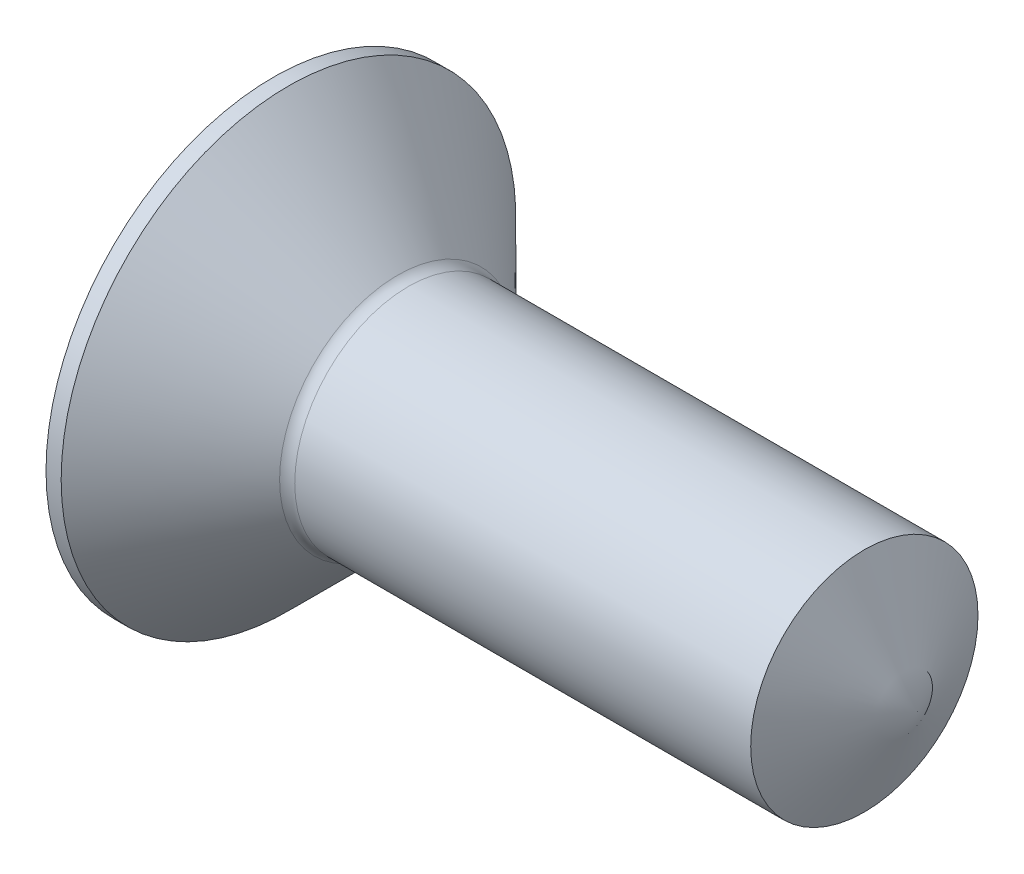
ISO-10303-21;
HEADER;
FILE_DESCRIPTION(('STEP AP214'),'2;1');
FILE_NAME('part.step','',(''),(''),'','','');
FILE_SCHEMA(('AUTOMOTIVE_DESIGN { 1 0 10303 214 1 1 1 1 }'));
ENDSEC;
DATA;
#1=APPLICATION_CONTEXT('core data for automotive mechanical design processes');
#2=APPLICATION_PROTOCOL_DEFINITION('international standard','automotive_design',2000,#1);
#3=PRODUCT_CONTEXT('',#1,'mechanical');
#4=PRODUCT('Part','Part','',(#3));
#5=PRODUCT_RELATED_PRODUCT_CATEGORY('part','',(#4));
#6=PRODUCT_DEFINITION_FORMATION('','',#4);
#7=PRODUCT_DEFINITION_CONTEXT('part definition',#1,'design');
#8=PRODUCT_DEFINITION('design','',#6,#7);
#9=PRODUCT_DEFINITION_SHAPE('','',#8);
#10=(LENGTH_UNIT() NAMED_UNIT(*) SI_UNIT(.MILLI.,.METRE.));
#11=(NAMED_UNIT(*) PLANE_ANGLE_UNIT() SI_UNIT($,.RADIAN.));
#12=(NAMED_UNIT(*) SI_UNIT($,.STERADIAN.) SOLID_ANGLE_UNIT());
#13=UNCERTAINTY_MEASURE_WITH_UNIT(LENGTH_MEASURE(1.E-05),#10,'distance_accuracy_value','');
#14=(GEOMETRIC_REPRESENTATION_CONTEXT(3) GLOBAL_UNCERTAINTY_ASSIGNED_CONTEXT((#13)) GLOBAL_UNIT_ASSIGNED_CONTEXT((#10,
#11,#12)) REPRESENTATION_CONTEXT('',''));
#15=CARTESIAN_POINT('',(0.,0.,0.));
#16=DIRECTION('',(0.,0.,1.));
#17=DIRECTION('',(1.,0.,0.));
#18=AXIS2_PLACEMENT_3D('',#15,#16,#17);
#19=CARTESIAN_POINT('',(-6.50645201269086,0.,0.));
#20=DIRECTION('',(-1.,0.,0.));
#21=DIRECTION('',(0.,0.,1.));
#22=AXIS2_PLACEMENT_3D('',#19,#20,#21);
#23=CYLINDRICAL_SURFACE('',#22,1.5);
#24=CARTESIAN_POINT('',(1.78284271247462,0.,0.));
#25=DIRECTION('',(-1.,0.,0.));
#26=DIRECTION('',(0.,0.,1.));
#27=AXIS2_PLACEMENT_3D('',#24,#25,#26);
#28=CIRCLE('',#27,1.5);
#29=CARTESIAN_POINT('',(1.78284271247462,0.,1.5));
#30=VERTEX_POINT('',#29);
#31=EDGE_CURVE('E12',#30,#30,#28,.F.);
#32=ORIENTED_EDGE('',*,*,#31,.T.);
#33=EDGE_LOOP('',(#32));
#34=FACE_BOUND('',#33,.T.);
#35=CARTESIAN_POINT('',(7.80053851276751,0.,0.));
#36=DIRECTION('',(-1.,0.,0.));
#37=DIRECTION('',(0.,0.,1.));
#38=AXIS2_PLACEMENT_3D('',#35,#36,#37);
#39=CIRCLE('',#38,1.5);
#40=CARTESIAN_POINT('',(7.80053851276751,0.,1.5));
#41=VERTEX_POINT('',#40);
#42=EDGE_CURVE('E130',#41,#41,#39,.F.);
#43=ORIENTED_EDGE('',*,*,#42,.F.);
#44=EDGE_LOOP('',(#43));
#45=FACE_BOUND('',#44,.T.);
#46=ADVANCED_FACE('F51',(#34,#45),#23,.T.);
#47=CARTESIAN_POINT('',(1.7,0.,0.));
#48=DIRECTION('',(-1.,0.,0.));
#49=DIRECTION('',(0.,0.,1.));
#50=AXIS2_PLACEMENT_3D('',#47,#48,#49);
#51=CONICAL_SURFACE('',#50,1.5,0.785398163397443);
#52=CARTESIAN_POINT('',(1.64142135623731,0.,0.));
#53=DIRECTION('',(-1.,0.,0.));
#54=DIRECTION('',(0.,0.,1.));
#55=AXIS2_PLACEMENT_3D('',#52,#53,#54);
#56=CIRCLE('',#55,1.55857864376269);
#57=CARTESIAN_POINT('',(1.64142135623731,0.,1.55857864376269));
#58=VERTEX_POINT('',#57);
#59=EDGE_CURVE('E60',#58,#58,#56,.T.);
#60=ORIENTED_EDGE('',*,*,#59,.T.);
#61=EDGE_LOOP('',(#60));
#62=FACE_BOUND('',#61,.T.);
#63=CARTESIAN_POINT('',(0.199999999999983,0.,0.));
#64=DIRECTION('',(-1.,0.,0.));
#65=DIRECTION('',(0.,0.,1.));
#66=AXIS2_PLACEMENT_3D('',#63,#64,#65);
#67=CIRCLE('',#66,3.);
#68=CARTESIAN_POINT('',(0.199999999999983,0.,3.));
#69=VERTEX_POINT('',#68);
#70=EDGE_CURVE('E467',#69,#69,#67,.T.);
#71=ORIENTED_EDGE('',*,*,#70,.F.);
#72=EDGE_LOOP('',(#71));
#73=FACE_BOUND('',#72,.T.);
#74=ADVANCED_FACE('F283',(#62,#73),#51,.T.);
#75=CARTESIAN_POINT('',(-6.50645201269086,0.,0.));
#76=DIRECTION('',(-1.,0.,0.));
#77=DIRECTION('',(0.,0.,1.));
#78=AXIS2_PLACEMENT_3D('',#75,#76,#77);
#79=CYLINDRICAL_SURFACE('',#78,3.);
#80=CARTESIAN_POINT('',(0.,0.,0.));
#81=DIRECTION('',(-1.,0.,0.));
#82=DIRECTION('',(0.,0.,1.));
#83=AXIS2_PLACEMENT_3D('',#80,#81,#82);
#84=CIRCLE('',#83,3.);
#85=CARTESIAN_POINT('',(0.,0.,3.));
#86=VERTEX_POINT('',#85);
#87=EDGE_CURVE('E133',#86,#86,#84,.T.);
#88=ORIENTED_EDGE('',*,*,#87,.F.);
#89=EDGE_LOOP('',(#88));
#90=FACE_BOUND('',#89,.T.);
#91=ORIENTED_EDGE('',*,*,#70,.T.);
#92=EDGE_LOOP('',(#91));
#93=FACE_BOUND('',#92,.T.);
#94=ADVANCED_FACE('F288',(#90,#93),#79,.T.);
#95=CARTESIAN_POINT('',(0.,0.,-3.));
#96=DIRECTION('',(1.,0.,0.));
#97=DIRECTION('',(0.,0.,-1.));
#98=AXIS2_PLACEMENT_3D('',#95,#96,#97);
#99=PLANE('',#98);
#100=DIRECTION('',(0.,0.,-1.));
#101=VECTOR('',#100,1.);
#102=CARTESIAN_POINT('',(0.,0.38,-0.38));
#103=LINE('',#102,#101);
#104=CARTESIAN_POINT('',(0.,0.38,-0.38));
#105=VERTEX_POINT('',#104);
#106=CARTESIAN_POINT('',(0.,0.38,-1.9));
#107=VERTEX_POINT('',#106);
#108=EDGE_CURVE('E112',#105,#107,#103,.T.);
#109=ORIENTED_EDGE('',*,*,#108,.F.);
#110=DIRECTION('',(0.,-1.,0.));
#111=VECTOR('',#110,1.);
#112=CARTESIAN_POINT('',(0.,0.38,-0.38));
#113=LINE('',#112,#111);
#114=CARTESIAN_POINT('',(0.,1.9,-0.38));
#115=VERTEX_POINT('',#114);
#116=EDGE_CURVE('E117',#115,#105,#113,.T.);
#117=ORIENTED_EDGE('',*,*,#116,.F.);
#118=DIRECTION('',(0.,0.,-1.));
#119=VECTOR('',#118,1.);
#120=CARTESIAN_POINT('',(0.,1.9,0.38));
#121=LINE('',#120,#119);
#122=CARTESIAN_POINT('',(0.,1.9,0.38));
#123=VERTEX_POINT('',#122);
#124=EDGE_CURVE('E124',#123,#115,#121,.T.);
#125=ORIENTED_EDGE('',*,*,#124,.F.);
#126=DIRECTION('',(0.,1.,0.));
#127=VECTOR('',#126,1.);
#128=CARTESIAN_POINT('',(0.,0.38,0.38));
#129=LINE('',#128,#127);
#130=CARTESIAN_POINT('',(0.,0.38,0.38));
#131=VERTEX_POINT('',#130);
#132=EDGE_CURVE('E174',#131,#123,#129,.T.);
#133=ORIENTED_EDGE('',*,*,#132,.F.);
#134=DIRECTION('',(0.,0.,-1.));
#135=VECTOR('',#134,1.);
#136=CARTESIAN_POINT('',(0.,0.380000000000001,1.9));
#137=LINE('',#136,#135);
#138=CARTESIAN_POINT('',(0.,0.380000000000001,1.9));
#139=VERTEX_POINT('',#138);
#140=EDGE_CURVE('E172',#139,#131,#137,.T.);
#141=ORIENTED_EDGE('',*,*,#140,.F.);
#142=DIRECTION('',(0.,1.,0.));
#143=VECTOR('',#142,1.);
#144=CARTESIAN_POINT('',(0.,0.380000000000001,1.9));
#145=LINE('',#144,#143);
#146=CARTESIAN_POINT('',(0.,-0.380000000000001,1.9));
#147=VERTEX_POINT('',#146);
#148=EDGE_CURVE('E168',#147,#139,#145,.T.);
#149=ORIENTED_EDGE('',*,*,#148,.F.);
#150=DIRECTION('',(0.,0.,1.));
#151=VECTOR('',#150,1.);
#152=CARTESIAN_POINT('',(0.,-0.380000000000001,1.9));
#153=LINE('',#152,#151);
#154=CARTESIAN_POINT('',(0.,-0.38,0.38));
#155=VERTEX_POINT('',#154);
#156=EDGE_CURVE('E164',#155,#147,#153,.T.);
#157=ORIENTED_EDGE('',*,*,#156,.F.);
#158=DIRECTION('',(0.,1.,0.));
#159=VECTOR('',#158,1.);
#160=CARTESIAN_POINT('',(0.,-1.9,0.380000000000001));
#161=LINE('',#160,#159);
#162=CARTESIAN_POINT('',(0.,-1.9,0.380000000000001));
#163=VERTEX_POINT('',#162);
#164=EDGE_CURVE('E160',#163,#155,#161,.T.);
#165=ORIENTED_EDGE('',*,*,#164,.F.);
#166=DIRECTION('',(0.,0.,1.));
#167=VECTOR('',#166,1.);
#168=CARTESIAN_POINT('',(0.,-1.9,0.380000000000001));
#169=LINE('',#168,#167);
#170=CARTESIAN_POINT('',(0.,-1.9,-0.38));
#171=VERTEX_POINT('',#170);
#172=EDGE_CURVE('E156',#171,#163,#169,.T.);
#173=ORIENTED_EDGE('',*,*,#172,.F.);
#174=DIRECTION('',(0.,-1.,0.));
#175=VECTOR('',#174,1.);
#176=CARTESIAN_POINT('',(0.,-1.9,-0.38));
#177=LINE('',#176,#175);
#178=CARTESIAN_POINT('',(0.,-0.38,-0.38));
#179=VERTEX_POINT('',#178);
#180=EDGE_CURVE('E159',#179,#171,#177,.T.);
#181=ORIENTED_EDGE('',*,*,#180,.F.);
#182=DIRECTION('',(0.,0.,1.));
#183=VECTOR('',#182,1.);
#184=CARTESIAN_POINT('',(0.,-0.38,-0.38));
#185=LINE('',#184,#183);
#186=CARTESIAN_POINT('',(0.,-0.38,-1.9));
#187=VERTEX_POINT('',#186);
#188=EDGE_CURVE('E135',#187,#179,#185,.T.);
#189=ORIENTED_EDGE('',*,*,#188,.F.);
#190=DIRECTION('',(0.,-1.,0.));
#191=VECTOR('',#190,1.);
#192=CARTESIAN_POINT('',(0.,0.38,-1.9));
#193=LINE('',#192,#191);
#194=EDGE_CURVE('E128',#107,#187,#193,.T.);
#195=ORIENTED_EDGE('',*,*,#194,.F.);
#196=EDGE_LOOP('',(#109,#117,#125,#133,#141,#149,#157,#165,#173,#181,#189,#195));
#197=FACE_BOUND('',#196,.T.);
#198=ORIENTED_EDGE('',*,*,#87,.T.);
#199=EDGE_LOOP('',(#198));
#200=FACE_BOUND('',#199,.T.);
#201=ADVANCED_FACE('F125',(#197,#200),#99,.F.);
#202=CARTESIAN_POINT('',(-0.826153163099912,0.,0.));
#203=DIRECTION('',(-1.,0.,0.));
#204=DIRECTION('',(0.,0.,1.));
#205=AXIS2_PLACEMENT_3D('',#202,#203,#204);
#206=CONICAL_SURFACE('',#205,20.,1.13446401379632);
#207=CARTESIAN_POINT('',(8.5,0.,0.));
#208=VERTEX_POINT('',#207);
#209=VERTEX_LOOP('',#208);
#210=FACE_BOUND('',#209,.T.);
#211=ORIENTED_EDGE('',*,*,#42,.T.);
#212=EDGE_LOOP('',(#211));
#213=FACE_BOUND('',#212,.T.);
#214=ADVANCED_FACE('F278',(#210,#213),#206,.T.);
#215=CARTESIAN_POINT('',(1.78284271247462,0.,0.));
#216=DIRECTION('',(-1.,0.,0.));
#217=DIRECTION('',(0.,0.,1.));
#218=AXIS2_PLACEMENT_3D('',#215,#216,#217);
#219=TOROIDAL_SURFACE('',#218,1.7,0.2);
#220=ORIENTED_EDGE('',*,*,#31,.F.);
#221=EDGE_LOOP('',(#220));
#222=FACE_BOUND('',#221,.T.);
#223=ORIENTED_EDGE('',*,*,#59,.F.);
#224=EDGE_LOOP('',(#223));
#225=FACE_BOUND('',#224,.T.);
#226=ADVANCED_FACE('F53',(#222,#225),#219,.F.);
#227=CARTESIAN_POINT('',(0.,1.9,-0.38));
#228=DIRECTION('',(0.191273821610312,0.,-0.981536716158181));
#229=DIRECTION('',(-0.981536716158182,0.,-0.191273821610312));
#230=AXIS2_PLACEMENT_3D('',#227,#228,#229);
#231=PLANE('',#230);
#232=DIRECTION('',(0.709353594431999,-0.691165040728615,0.138233008145723));
#233=VECTOR('',#232,1.);
#234=CARTESIAN_POINT('',(0.,1.9,-0.38));
#235=LINE('',#234,#233);
#236=CARTESIAN_POINT('',(1.95,0.,0.));
#237=VERTEX_POINT('',#236);
#238=EDGE_CURVE('E118',#115,#237,#235,.T.);
#239=ORIENTED_EDGE('',*,*,#238,.F.);
#240=ORIENTED_EDGE('',*,*,#116,.T.);
#241=DIRECTION('',(0.964059743790518,-0.187868052636101,0.187868052636101));
#242=VECTOR('',#241,1.);
#243=CARTESIAN_POINT('',(0.,0.38,-0.38));
#244=LINE('',#243,#242);
#245=EDGE_CURVE('E108',#105,#237,#244,.T.);
#246=ORIENTED_EDGE('',*,*,#245,.T.);
#247=EDGE_LOOP('',(#239,#240,#246));
#248=FACE_BOUND('',#247,.T.);
#249=ADVANCED_FACE('F121',(#248),#231,.F.);
#250=CARTESIAN_POINT('',(0.,0.38,-0.38));
#251=DIRECTION('',(0.191273821610312,0.981536716158181,0.));
#252=DIRECTION('',(-0.981536716158182,0.191273821610312,0.));
#253=AXIS2_PLACEMENT_3D('',#250,#251,#252);
#254=PLANE('',#253);
#255=ORIENTED_EDGE('',*,*,#245,.F.);
#256=ORIENTED_EDGE('',*,*,#108,.T.);
#257=DIRECTION('',(0.709353594431999,-0.138233008145723,0.691165040728615));
#258=VECTOR('',#257,1.);
#259=CARTESIAN_POINT('',(0.,0.38,-1.9));
#260=LINE('',#259,#258);
#261=EDGE_CURVE('E68',#107,#237,#260,.T.);
#262=ORIENTED_EDGE('',*,*,#261,.T.);
#263=EDGE_LOOP('',(#255,#256,#262));
#264=FACE_BOUND('',#263,.T.);
#265=ADVANCED_FACE('F110',(#264),#254,.F.);
#266=CARTESIAN_POINT('',(0.,1.9,0.38));
#267=DIRECTION('',(0.697864726910429,0.716229588144914,0.));
#268=DIRECTION('',(-0.716229588144914,0.697864726910429,0.));
#269=AXIS2_PLACEMENT_3D('',#266,#267,#268);
#270=PLANE('',#269);
#271=DIRECTION('',(0.709353594431999,-0.691165040728615,-0.138233008145723));
#272=VECTOR('',#271,1.);
#273=CARTESIAN_POINT('',(0.,1.9,0.38));
#274=LINE('',#273,#272);
#275=EDGE_CURVE('E184',#123,#237,#274,.T.);
#276=ORIENTED_EDGE('',*,*,#275,.F.);
#277=ORIENTED_EDGE('',*,*,#124,.T.);
#278=ORIENTED_EDGE('',*,*,#238,.T.);
#279=EDGE_LOOP('',(#276,#277,#278));
#280=FACE_BOUND('',#279,.T.);
#281=ADVANCED_FACE('F183',(#280),#270,.F.);
#282=CARTESIAN_POINT('',(0.,0.38,0.38));
#283=DIRECTION('',(0.191273821610312,0.,0.981536716158181));
#284=DIRECTION('',(0.981536716158181,0.,-0.191273821610312));
#285=AXIS2_PLACEMENT_3D('',#282,#283,#284);
#286=PLANE('',#285);
#287=DIRECTION('',(0.964059743790518,-0.187868052636101,-0.187868052636101));
#288=VECTOR('',#287,1.);
#289=CARTESIAN_POINT('',(0.,0.38,0.38));
#290=LINE('',#289,#288);
#291=EDGE_CURVE('E335',#131,#237,#290,.T.);
#292=ORIENTED_EDGE('',*,*,#291,.F.);
#293=ORIENTED_EDGE('',*,*,#132,.T.);
#294=ORIENTED_EDGE('',*,*,#275,.T.);
#295=EDGE_LOOP('',(#292,#293,#294));
#296=FACE_BOUND('',#295,.T.);
#297=ADVANCED_FACE('F204',(#296),#286,.F.);
#298=CARTESIAN_POINT('',(0.,0.380000000000001,1.9));
#299=DIRECTION('',(0.191273821610312,0.981536716158181,0.));
#300=DIRECTION('',(-0.981536716158182,0.191273821610312,0.));
#301=AXIS2_PLACEMENT_3D('',#298,#299,#300);
#302=PLANE('',#301);
#303=DIRECTION('',(0.709353594431999,-0.138233008145723,-0.691165040728615));
#304=VECTOR('',#303,1.);
#305=CARTESIAN_POINT('',(0.,0.380000000000001,1.9));
#306=LINE('',#305,#304);
#307=EDGE_CURVE('E233',#139,#237,#306,.T.);
#308=ORIENTED_EDGE('',*,*,#307,.F.);
#309=ORIENTED_EDGE('',*,*,#140,.T.);
#310=ORIENTED_EDGE('',*,*,#291,.T.);
#311=EDGE_LOOP('',(#308,#309,#310));
#312=FACE_BOUND('',#311,.T.);
#313=ADVANCED_FACE('F208',(#312),#302,.F.);
#314=CARTESIAN_POINT('',(0.,-0.380000000000001,1.9));
#315=DIRECTION('',(0.697864726910429,0.,0.716229588144914));
#316=DIRECTION('',(0.716229588144914,0.,-0.697864726910429));
#317=AXIS2_PLACEMENT_3D('',#314,#315,#316);
#318=PLANE('',#317);
#319=DIRECTION('',(0.709353594431999,0.138233008145723,-0.691165040728615));
#320=VECTOR('',#319,1.);
#321=CARTESIAN_POINT('',(0.,-0.380000000000001,1.9));
#322=LINE('',#321,#320);
#323=EDGE_CURVE('E225',#147,#237,#322,.T.);
#324=ORIENTED_EDGE('',*,*,#323,.F.);
#325=ORIENTED_EDGE('',*,*,#148,.T.);
#326=ORIENTED_EDGE('',*,*,#307,.T.);
#327=EDGE_LOOP('',(#324,#325,#326));
#328=FACE_BOUND('',#327,.T.);
#329=ADVANCED_FACE('F211',(#328),#318,.F.);
#330=CARTESIAN_POINT('',(0.,-0.38,0.38));
#331=DIRECTION('',(0.191273821610312,-0.981536716158181,0.));
#332=DIRECTION('',(0.981536716158182,0.191273821610312,0.));
#333=AXIS2_PLACEMENT_3D('',#330,#331,#332);
#334=PLANE('',#333);
#335=DIRECTION('',(0.964059743790518,0.187868052636101,-0.187868052636101));
#336=VECTOR('',#335,1.);
#337=CARTESIAN_POINT('',(0.,-0.38,0.38));
#338=LINE('',#337,#336);
#339=EDGE_CURVE('E234',#155,#237,#338,.T.);
#340=ORIENTED_EDGE('',*,*,#339,.F.);
#341=ORIENTED_EDGE('',*,*,#156,.T.);
#342=ORIENTED_EDGE('',*,*,#323,.T.);
#343=EDGE_LOOP('',(#340,#341,#342));
#344=FACE_BOUND('',#343,.T.);
#345=ADVANCED_FACE('F216',(#344),#334,.F.);
#346=CARTESIAN_POINT('',(0.,-1.9,0.380000000000001));
#347=DIRECTION('',(0.191273821610312,0.,0.981536716158181));
#348=DIRECTION('',(0.981536716158181,0.,-0.191273821610312));
#349=AXIS2_PLACEMENT_3D('',#346,#347,#348);
#350=PLANE('',#349);
#351=DIRECTION('',(0.709353594431999,0.691165040728615,-0.138233008145723));
#352=VECTOR('',#351,1.);
#353=CARTESIAN_POINT('',(0.,-1.9,0.380000000000001));
#354=LINE('',#353,#352);
#355=EDGE_CURVE('E239',#163,#237,#354,.T.);
#356=ORIENTED_EDGE('',*,*,#355,.F.);
#357=ORIENTED_EDGE('',*,*,#164,.T.);
#358=ORIENTED_EDGE('',*,*,#339,.T.);
#359=EDGE_LOOP('',(#356,#357,#358));
#360=FACE_BOUND('',#359,.T.);
#361=ADVANCED_FACE('F267',(#360),#350,.F.);
#362=CARTESIAN_POINT('',(0.,-1.9,-0.38));
#363=DIRECTION('',(0.697864726910429,-0.716229588144914,0.));
#364=DIRECTION('',(0.716229588144914,0.697864726910429,0.));
#365=AXIS2_PLACEMENT_3D('',#362,#363,#364);
#366=PLANE('',#365);
#367=DIRECTION('',(0.709353594431999,0.691165040728615,0.138233008145723));
#368=VECTOR('',#367,1.);
#369=CARTESIAN_POINT('',(0.,-1.9,-0.38));
#370=LINE('',#369,#368);
#371=EDGE_CURVE('E244',#171,#237,#370,.T.);
#372=ORIENTED_EDGE('',*,*,#371,.F.);
#373=ORIENTED_EDGE('',*,*,#172,.T.);
#374=ORIENTED_EDGE('',*,*,#355,.T.);
#375=EDGE_LOOP('',(#372,#373,#374));
#376=FACE_BOUND('',#375,.T.);
#377=ADVANCED_FACE('F257',(#376),#366,.F.);
#378=CARTESIAN_POINT('',(0.,-0.38,-0.38));
#379=DIRECTION('',(0.191273821610312,0.,-0.981536716158181));
#380=DIRECTION('',(-0.981536716158182,0.,-0.191273821610312));
#381=AXIS2_PLACEMENT_3D('',#378,#379,#380);
#382=PLANE('',#381);
#383=DIRECTION('',(0.964059743790518,0.187868052636101,0.187868052636101));
#384=VECTOR('',#383,1.);
#385=CARTESIAN_POINT('',(0.,-0.38,-0.38));
#386=LINE('',#385,#384);
#387=EDGE_CURVE('E324',#179,#237,#386,.T.);
#388=ORIENTED_EDGE('',*,*,#387,.F.);
#389=ORIENTED_EDGE('',*,*,#180,.T.);
#390=ORIENTED_EDGE('',*,*,#371,.T.);
#391=EDGE_LOOP('',(#388,#389,#390));
#392=FACE_BOUND('',#391,.T.);
#393=ADVANCED_FACE('F266',(#392),#382,.F.);
#394=CARTESIAN_POINT('',(0.,-0.38,-1.9));
#395=DIRECTION('',(0.191273821610312,-0.981536716158181,0.));
#396=DIRECTION('',(0.981536716158182,0.191273821610312,0.));
#397=AXIS2_PLACEMENT_3D('',#394,#395,#396);
#398=PLANE('',#397);
#399=DIRECTION('',(0.709353594431999,0.138233008145723,0.691165040728615));
#400=VECTOR('',#399,1.);
#401=CARTESIAN_POINT('',(0.,-0.38,-1.9));
#402=LINE('',#401,#400);
#403=EDGE_CURVE('E346',#187,#237,#402,.T.);
#404=ORIENTED_EDGE('',*,*,#403,.F.);
#405=ORIENTED_EDGE('',*,*,#188,.T.);
#406=ORIENTED_EDGE('',*,*,#387,.T.);
#407=EDGE_LOOP('',(#404,#405,#406));
#408=FACE_BOUND('',#407,.T.);
#409=ADVANCED_FACE('F270',(#408),#398,.F.);
#410=CARTESIAN_POINT('',(0.,0.38,-1.9));
#411=DIRECTION('',(0.697864726910429,0.,-0.716229588144914));
#412=DIRECTION('',(-0.716229588144914,0.,-0.697864726910429));
#413=AXIS2_PLACEMENT_3D('',#410,#411,#412);
#414=PLANE('',#413);
#415=ORIENTED_EDGE('',*,*,#261,.F.);
#416=ORIENTED_EDGE('',*,*,#194,.T.);
#417=ORIENTED_EDGE('',*,*,#403,.T.);
#418=EDGE_LOOP('',(#415,#416,#417));
#419=FACE_BOUND('',#418,.T.);
#420=ADVANCED_FACE('F273',(#419),#414,.F.);
#421=CLOSED_SHELL('',(#46,#74,#94,#201,#214,#226,#249,#265,#281,#297,#313,#329,#345,#361,#377,
#393,#409,#420));
#422=MANIFOLD_SOLID_BREP('B2',#421);
#423=ADVANCED_BREP_SHAPE_REPRESENTATION('',(#18,#422),#14);
#424=SHAPE_DEFINITION_REPRESENTATION(#9,#423);
ENDSEC;
END-ISO-10303-21;
